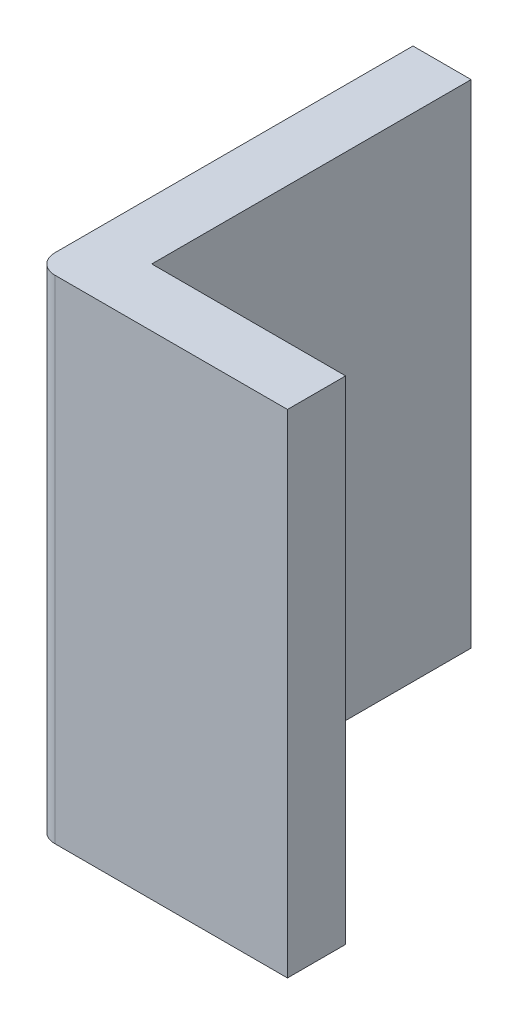
ISO-10303-21;
HEADER;
FILE_DESCRIPTION(('STEP AP214'),'2;1');
FILE_NAME('part.step','',(''),(''),'','','');
FILE_SCHEMA(('AUTOMOTIVE_DESIGN { 1 0 10303 214 1 1 1 1 }'));
ENDSEC;
DATA;
#1=APPLICATION_CONTEXT('core data for automotive mechanical design processes');
#2=APPLICATION_PROTOCOL_DEFINITION('international standard','automotive_design',2000,#1);
#3=PRODUCT_CONTEXT('',#1,'mechanical');
#4=PRODUCT('Part','Part','',(#3));
#5=PRODUCT_RELATED_PRODUCT_CATEGORY('part','',(#4));
#6=PRODUCT_DEFINITION_FORMATION('','',#4);
#7=PRODUCT_DEFINITION_CONTEXT('part definition',#1,'design');
#8=PRODUCT_DEFINITION('design','',#6,#7);
#9=PRODUCT_DEFINITION_SHAPE('','',#8);
#10=(LENGTH_UNIT() NAMED_UNIT(*) SI_UNIT(.MILLI.,.METRE.));
#11=(NAMED_UNIT(*) PLANE_ANGLE_UNIT() SI_UNIT($,.RADIAN.));
#12=(NAMED_UNIT(*) SI_UNIT($,.STERADIAN.) SOLID_ANGLE_UNIT());
#13=UNCERTAINTY_MEASURE_WITH_UNIT(LENGTH_MEASURE(1.E-05),#10,'distance_accuracy_value','');
#14=(GEOMETRIC_REPRESENTATION_CONTEXT(3) GLOBAL_UNCERTAINTY_ASSIGNED_CONTEXT((#13)) GLOBAL_UNIT_ASSIGNED_CONTEXT((#10,
#11,#12)) REPRESENTATION_CONTEXT('',''));
#15=CARTESIAN_POINT('',(0.,0.,0.));
#16=DIRECTION('',(0.,0.,1.));
#17=DIRECTION('',(1.,0.,0.));
#18=AXIS2_PLACEMENT_3D('',#15,#16,#17);
#19=CARTESIAN_POINT('',(0.,2.54,0.));
#20=DIRECTION('',(0.,0.,1.));
#21=DIRECTION('',(1.,0.,0.));
#22=AXIS2_PLACEMENT_3D('',#19,#20,#21);
#23=PLANE('',#22);
#24=DIRECTION('',(-1.,0.,0.));
#25=VECTOR('',#24,1.);
#26=CARTESIAN_POINT('',(0.,0.,0.));
#27=LINE('',#26,#25);
#28=CARTESIAN_POINT('',(1.,0.,0.));
#29=VERTEX_POINT('',#28);
#30=CARTESIAN_POINT('',(0.,0.,0.));
#31=VERTEX_POINT('',#30);
#32=EDGE_CURVE('E121',#29,#31,#27,.T.);
#33=ORIENTED_EDGE('',*,*,#32,.T.);
#34=DIRECTION('',(0.,-1.,0.));
#35=VECTOR('',#34,1.);
#36=CARTESIAN_POINT('',(0.,2.54,0.));
#37=LINE('',#36,#35);
#38=CARTESIAN_POINT('',(0.,2.54,0.));
#39=VERTEX_POINT('',#38);
#40=EDGE_CURVE('E11',#39,#31,#37,.T.);
#41=ORIENTED_EDGE('',*,*,#40,.F.);
#42=DIRECTION('',(-1.,0.,0.));
#43=VECTOR('',#42,1.);
#44=CARTESIAN_POINT('',(0.,2.54,0.));
#45=LINE('',#44,#43);
#46=CARTESIAN_POINT('',(1.,2.54,0.));
#47=VERTEX_POINT('',#46);
#48=EDGE_CURVE('E133',#47,#39,#45,.T.);
#49=ORIENTED_EDGE('',*,*,#48,.F.);
#50=DIRECTION('',(0.,-1.,0.));
#51=VECTOR('',#50,1.);
#52=CARTESIAN_POINT('',(1.,2.54,0.));
#53=LINE('',#52,#51);
#54=EDGE_CURVE('E117',#47,#29,#53,.T.);
#55=ORIENTED_EDGE('',*,*,#54,.T.);
#56=EDGE_LOOP('',(#33,#41,#49,#55));
#57=FACE_BOUND('',#56,.T.);
#58=ADVANCED_FACE('F31',(#57),#23,.F.);
#59=CARTESIAN_POINT('',(0.,2.54,0.));
#60=DIRECTION('',(-1.,0.,0.));
#61=DIRECTION('',(0.,0.,1.));
#62=AXIS2_PLACEMENT_3D('',#59,#60,#61);
#63=PLANE('',#62);
#64=DIRECTION('',(0.,0.,-1.));
#65=VECTOR('',#64,1.);
#66=CARTESIAN_POINT('',(0.,0.,0.));
#67=LINE('',#66,#65);
#68=CARTESIAN_POINT('',(0.,0.,-1.64744493587908));
#69=VERTEX_POINT('',#68);
#70=EDGE_CURVE('E124',#31,#69,#67,.T.);
#71=ORIENTED_EDGE('',*,*,#70,.T.);
#72=DIRECTION('',(0.,-1.,0.));
#73=VECTOR('',#72,1.);
#74=CARTESIAN_POINT('',(0.,2.54,-1.64744493587908));
#75=LINE('',#74,#73);
#76=CARTESIAN_POINT('',(0.,2.54,-1.64744493587908));
#77=VERTEX_POINT('',#76);
#78=EDGE_CURVE('E39',#77,#69,#75,.T.);
#79=ORIENTED_EDGE('',*,*,#78,.F.);
#80=DIRECTION('',(0.,0.,-1.));
#81=VECTOR('',#80,1.);
#82=CARTESIAN_POINT('',(0.,2.54,0.));
#83=LINE('',#82,#81);
#84=EDGE_CURVE('E87',#39,#77,#83,.T.);
#85=ORIENTED_EDGE('',*,*,#84,.F.);
#86=ORIENTED_EDGE('',*,*,#40,.T.);
#87=EDGE_LOOP('',(#71,#79,#85,#86));
#88=FACE_BOUND('',#87,.T.);
#89=ADVANCED_FACE('F158',(#88),#63,.F.);
#90=CARTESIAN_POINT('',(-0.3,2.54,-1.64744493587908));
#91=DIRECTION('',(0.,0.,1.));
#92=DIRECTION('',(1.,0.,0.));
#93=AXIS2_PLACEMENT_3D('',#90,#91,#92);
#94=PLANE('',#93);
#95=DIRECTION('',(-1.,0.,0.));
#96=VECTOR('',#95,1.);
#97=CARTESIAN_POINT('',(-0.3,0.,-1.64744493587908));
#98=LINE('',#97,#96);
#99=CARTESIAN_POINT('',(-0.3,0.,-1.64744493587908));
#100=VERTEX_POINT('',#99);
#101=EDGE_CURVE('E126',#69,#100,#98,.T.);
#102=ORIENTED_EDGE('',*,*,#101,.T.);
#103=DIRECTION('',(0.,-1.,0.));
#104=VECTOR('',#103,1.);
#105=CARTESIAN_POINT('',(-0.3,2.54,-1.64744493587908));
#106=LINE('',#105,#104);
#107=CARTESIAN_POINT('',(-0.3,2.54,-1.64744493587908));
#108=VERTEX_POINT('',#107);
#109=EDGE_CURVE('E137',#108,#100,#106,.T.);
#110=ORIENTED_EDGE('',*,*,#109,.F.);
#111=DIRECTION('',(-1.,0.,0.));
#112=VECTOR('',#111,1.);
#113=CARTESIAN_POINT('',(-0.3,2.54,-1.64744493587908));
#114=LINE('',#113,#112);
#115=EDGE_CURVE('E145',#77,#108,#114,.T.);
#116=ORIENTED_EDGE('',*,*,#115,.F.);
#117=ORIENTED_EDGE('',*,*,#78,.T.);
#118=EDGE_LOOP('',(#102,#110,#116,#117));
#119=FACE_BOUND('',#118,.T.);
#120=ADVANCED_FACE('F143',(#119),#94,.F.);
#121=CARTESIAN_POINT('',(-0.3,2.54,0.199999999999999));
#122=DIRECTION('',(1.,0.,0.));
#123=DIRECTION('',(0.,0.,-1.));
#124=AXIS2_PLACEMENT_3D('',#121,#122,#123);
#125=PLANE('',#124);
#126=DIRECTION('',(0.,0.,1.));
#127=VECTOR('',#126,1.);
#128=CARTESIAN_POINT('',(-0.3,0.,0.199999999999999));
#129=LINE('',#128,#127);
#130=CARTESIAN_POINT('',(-0.3,0.,0.199999999999999));
#131=VERTEX_POINT('',#130);
#132=EDGE_CURVE('E128',#100,#131,#129,.T.);
#133=ORIENTED_EDGE('',*,*,#132,.T.);
#134=DIRECTION('',(0.,-1.,0.));
#135=VECTOR('',#134,1.);
#136=CARTESIAN_POINT('',(-0.3,2.54,0.199999999999999));
#137=LINE('',#136,#135);
#138=CARTESIAN_POINT('',(-0.3,2.54,0.199999999999999));
#139=VERTEX_POINT('',#138);
#140=EDGE_CURVE('E112',#139,#131,#137,.T.);
#141=ORIENTED_EDGE('',*,*,#140,.F.);
#142=DIRECTION('',(0.,0.,1.));
#143=VECTOR('',#142,1.);
#144=CARTESIAN_POINT('',(-0.3,2.54,0.199999999999999));
#145=LINE('',#144,#143);
#146=EDGE_CURVE('E103',#108,#139,#145,.T.);
#147=ORIENTED_EDGE('',*,*,#146,.F.);
#148=ORIENTED_EDGE('',*,*,#109,.T.);
#149=EDGE_LOOP('',(#133,#141,#147,#148));
#150=FACE_BOUND('',#149,.T.);
#151=ADVANCED_FACE('F151',(#150),#125,.F.);
#152=CARTESIAN_POINT('',(-0.2,2.54,0.2));
#153=DIRECTION('',(0.,-1.,0.));
#154=DIRECTION('',(0.,0.,-1.));
#155=AXIS2_PLACEMENT_3D('',#152,#153,#154);
#156=CYLINDRICAL_SURFACE('',#155,0.1);
#157=CARTESIAN_POINT('',(-0.2,0.,0.2));
#158=DIRECTION('',(0.,1.,0.));
#159=DIRECTION('',(0.,0.,-1.));
#160=AXIS2_PLACEMENT_3D('',#157,#158,#159);
#161=CIRCLE('',#160,0.1);
#162=CARTESIAN_POINT('',(-0.199999999999999,0.,0.3));
#163=VERTEX_POINT('',#162);
#164=EDGE_CURVE('E111',#131,#163,#161,.T.);
#165=ORIENTED_EDGE('',*,*,#164,.T.);
#166=DIRECTION('',(0.,-1.,0.));
#167=VECTOR('',#166,1.);
#168=CARTESIAN_POINT('',(-0.199999999999999,2.54,0.3));
#169=LINE('',#168,#167);
#170=CARTESIAN_POINT('',(-0.199999999999999,2.54,0.3));
#171=VERTEX_POINT('',#170);
#172=EDGE_CURVE('E108',#171,#163,#169,.T.);
#173=ORIENTED_EDGE('',*,*,#172,.F.);
#174=CARTESIAN_POINT('',(-0.2,2.54,0.2));
#175=DIRECTION('',(0.,1.,0.));
#176=DIRECTION('',(0.,0.,-1.));
#177=AXIS2_PLACEMENT_3D('',#174,#175,#176);
#178=CIRCLE('',#177,0.1);
#179=EDGE_CURVE('E97',#139,#171,#178,.T.);
#180=ORIENTED_EDGE('',*,*,#179,.F.);
#181=ORIENTED_EDGE('',*,*,#140,.T.);
#182=EDGE_LOOP('',(#165,#173,#180,#181));
#183=FACE_BOUND('',#182,.T.);
#184=ADVANCED_FACE('F109',(#183),#156,.T.);
#185=CARTESIAN_POINT('',(-0.199999999999999,2.54,0.3));
#186=DIRECTION('',(0.,0.,-1.));
#187=DIRECTION('',(-1.,0.,0.));
#188=AXIS2_PLACEMENT_3D('',#185,#186,#187);
#189=PLANE('',#188);
#190=DIRECTION('',(1.,0.,0.));
#191=VECTOR('',#190,1.);
#192=CARTESIAN_POINT('',(-0.199999999999999,0.,0.3));
#193=LINE('',#192,#191);
#194=CARTESIAN_POINT('',(1.,0.,0.3));
#195=VERTEX_POINT('',#194);
#196=EDGE_CURVE('E73',#163,#195,#193,.T.);
#197=ORIENTED_EDGE('',*,*,#196,.T.);
#198=DIRECTION('',(0.,-1.,0.));
#199=VECTOR('',#198,1.);
#200=CARTESIAN_POINT('',(1.,2.54,0.3));
#201=LINE('',#200,#199);
#202=CARTESIAN_POINT('',(1.,2.54,0.3));
#203=VERTEX_POINT('',#202);
#204=EDGE_CURVE('E113',#203,#195,#201,.T.);
#205=ORIENTED_EDGE('',*,*,#204,.F.);
#206=DIRECTION('',(1.,0.,0.));
#207=VECTOR('',#206,1.);
#208=CARTESIAN_POINT('',(-0.199999999999999,2.54,0.3));
#209=LINE('',#208,#207);
#210=EDGE_CURVE('E101',#171,#203,#209,.T.);
#211=ORIENTED_EDGE('',*,*,#210,.F.);
#212=ORIENTED_EDGE('',*,*,#172,.T.);
#213=EDGE_LOOP('',(#197,#205,#211,#212));
#214=FACE_BOUND('',#213,.T.);
#215=ADVANCED_FACE('F115',(#214),#189,.F.);
#216=CARTESIAN_POINT('',(1.,2.54,0.));
#217=DIRECTION('',(-1.,0.,0.));
#218=DIRECTION('',(0.,0.,1.));
#219=AXIS2_PLACEMENT_3D('',#216,#217,#218);
#220=PLANE('',#219);
#221=DIRECTION('',(0.,0.,-1.));
#222=VECTOR('',#221,1.);
#223=CARTESIAN_POINT('',(1.,0.,0.));
#224=LINE('',#223,#222);
#225=EDGE_CURVE('E79',#195,#29,#224,.T.);
#226=ORIENTED_EDGE('',*,*,#225,.T.);
#227=ORIENTED_EDGE('',*,*,#54,.F.);
#228=DIRECTION('',(0.,0.,-1.));
#229=VECTOR('',#228,1.);
#230=CARTESIAN_POINT('',(1.,2.54,0.));
#231=LINE('',#230,#229);
#232=EDGE_CURVE('E47',#203,#47,#231,.T.);
#233=ORIENTED_EDGE('',*,*,#232,.F.);
#234=ORIENTED_EDGE('',*,*,#204,.T.);
#235=EDGE_LOOP('',(#226,#227,#233,#234));
#236=FACE_BOUND('',#235,.T.);
#237=ADVANCED_FACE('F172',(#236),#220,.F.);
#238=CARTESIAN_POINT('',(-0.2,2.54,0.2));
#239=DIRECTION('',(0.,-1.,0.));
#240=DIRECTION('',(0.,0.,-1.));
#241=AXIS2_PLACEMENT_3D('',#238,#239,#240);
#242=PLANE('',#241);
#243=ORIENTED_EDGE('',*,*,#48,.T.);
#244=ORIENTED_EDGE('',*,*,#84,.T.);
#245=ORIENTED_EDGE('',*,*,#115,.T.);
#246=ORIENTED_EDGE('',*,*,#146,.T.);
#247=ORIENTED_EDGE('',*,*,#179,.T.);
#248=ORIENTED_EDGE('',*,*,#210,.T.);
#249=ORIENTED_EDGE('',*,*,#232,.T.);
#250=EDGE_LOOP('',(#243,#244,#245,#246,#247,#248,#249));
#251=FACE_BOUND('',#250,.T.);
#252=ADVANCED_FACE('F99',(#251),#242,.F.);
#253=CARTESIAN_POINT('',(-0.2,0.,0.2));
#254=DIRECTION('',(0.,-1.,0.));
#255=DIRECTION('',(0.,0.,-1.));
#256=AXIS2_PLACEMENT_3D('',#253,#254,#255);
#257=PLANE('',#256);
#258=ORIENTED_EDGE('',*,*,#32,.F.);
#259=ORIENTED_EDGE('',*,*,#225,.F.);
#260=ORIENTED_EDGE('',*,*,#196,.F.);
#261=ORIENTED_EDGE('',*,*,#164,.F.);
#262=ORIENTED_EDGE('',*,*,#132,.F.);
#263=ORIENTED_EDGE('',*,*,#101,.F.);
#264=ORIENTED_EDGE('',*,*,#70,.F.);
#265=EDGE_LOOP('',(#258,#259,#260,#261,#262,#263,#264));
#266=FACE_BOUND('',#265,.T.);
#267=ADVANCED_FACE('F149',(#266),#257,.T.);
#268=CLOSED_SHELL('',(#58,#89,#120,#151,#184,#215,#237,#252,#267));
#269=MANIFOLD_SOLID_BREP('B2',#268);
#270=ADVANCED_BREP_SHAPE_REPRESENTATION('',(#18,#269),#14);
#271=SHAPE_DEFINITION_REPRESENTATION(#9,#270);
ENDSEC;
END-ISO-10303-21;
